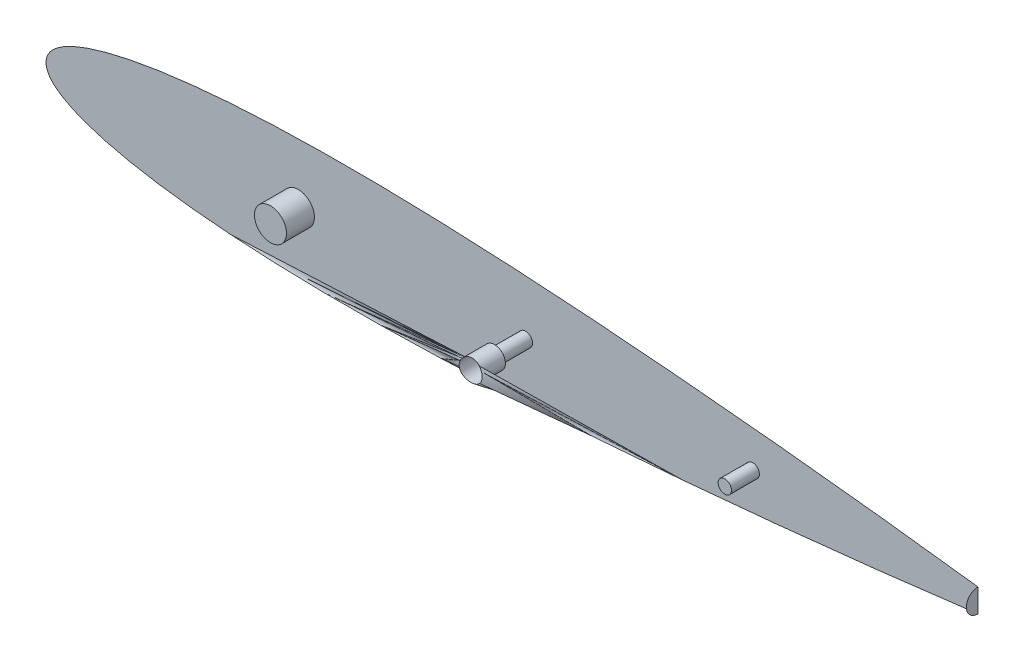
ISO-10303-21;
HEADER;
FILE_DESCRIPTION(('STEP AP214'),'2;1');
FILE_NAME('part.step','',(''),(''),'','','');
FILE_SCHEMA(('AUTOMOTIVE_DESIGN { 1 0 10303 214 1 1 1 1 }'));
ENDSEC;
DATA;
#1=APPLICATION_CONTEXT('core data for automotive mechanical design processes');
#2=APPLICATION_PROTOCOL_DEFINITION('international standard','automotive_design',2000,#1);
#3=PRODUCT_CONTEXT('',#1,'mechanical');
#4=PRODUCT('Part','Part','',(#3));
#5=PRODUCT_RELATED_PRODUCT_CATEGORY('part','',(#4));
#6=PRODUCT_DEFINITION_FORMATION('','',#4);
#7=PRODUCT_DEFINITION_CONTEXT('part definition',#1,'design');
#8=PRODUCT_DEFINITION('design','',#6,#7);
#9=PRODUCT_DEFINITION_SHAPE('','',#8);
#10=(LENGTH_UNIT() NAMED_UNIT(*) SI_UNIT(.MILLI.,.METRE.));
#11=(NAMED_UNIT(*) PLANE_ANGLE_UNIT() SI_UNIT($,.RADIAN.));
#12=(NAMED_UNIT(*) SI_UNIT($,.STERADIAN.) SOLID_ANGLE_UNIT());
#13=UNCERTAINTY_MEASURE_WITH_UNIT(LENGTH_MEASURE(1.E-05),#10,'distance_accuracy_value','');
#14=(GEOMETRIC_REPRESENTATION_CONTEXT(3) GLOBAL_UNCERTAINTY_ASSIGNED_CONTEXT((#13)) GLOBAL_UNIT_ASSIGNED_CONTEXT((#10,
#11,#12)) REPRESENTATION_CONTEXT('',''));
#15=CARTESIAN_POINT('',(0.,0.,0.));
#16=DIRECTION('',(0.,0.,1.));
#17=DIRECTION('',(1.,0.,0.));
#18=AXIS2_PLACEMENT_3D('',#15,#16,#17);
#19=CARTESIAN_POINT('',(154.375,0.,9.));
#20=DIRECTION('',(0.,0.,-1.));
#21=DIRECTION('',(-1.,0.,0.));
#22=AXIS2_PLACEMENT_3D('',#19,#20,#21);
#23=CYLINDRICAL_SURFACE('',#22,2.25000000000001);
#24=CARTESIAN_POINT('',(154.375,0.,0.));
#25=DIRECTION('',(0.,0.,1.));
#26=DIRECTION('',(1.,0.,0.));
#27=AXIS2_PLACEMENT_3D('',#24,#25,#26);
#28=CIRCLE('',#27,2.25000000000001);
#29=CARTESIAN_POINT('',(156.625,0.,0.));
#30=VERTEX_POINT('',#29);
#31=EDGE_CURVE('E72',#30,#30,#28,.T.);
#32=ORIENTED_EDGE('',*,*,#31,.F.);
#33=EDGE_LOOP('',(#32));
#34=FACE_BOUND('',#33,.T.);
#35=CARTESIAN_POINT('',(154.375,0.,10.));
#36=DIRECTION('',(0.,0.,1.));
#37=DIRECTION('',(1.,0.,0.));
#38=AXIS2_PLACEMENT_3D('',#35,#36,#37);
#39=CIRCLE('',#38,2.25000000000001);
#40=CARTESIAN_POINT('',(156.625,0.,10.));
#41=VERTEX_POINT('',#40);
#42=EDGE_CURVE('E93',#41,#41,#39,.T.);
#43=ORIENTED_EDGE('',*,*,#42,.T.);
#44=EDGE_LOOP('',(#43));
#45=FACE_BOUND('',#44,.T.);
#46=ADVANCED_FACE('F40',(#34,#45),#23,.F.);
#47=CARTESIAN_POINT('',(325.,-0.409500092908203,0.));
#48=CARTESIAN_POINT('',(324.209606779707,-0.519399758019909,0.));
#49=CARTESIAN_POINT('',(322.004222005564,-0.826045920838513,0.));
#50=CARTESIAN_POINT('',(318.131286115593,-1.36247994027025,0.));
#51=CARTESIAN_POINT('',(313.205110101778,-2.03042977351965,0.));
#52=CARTESIAN_POINT('',(307.754214134533,-2.75656118579781,0.));
#53=CARTESIAN_POINT('',(301.981376014149,-3.50796663809339,0.));
#54=CARTESIAN_POINT('',(296.03805070342,-4.26285960583456,0.));
#55=CARTESIAN_POINT('',(290.014777157156,-5.01477274249634,0.));
#56=CARTESIAN_POINT('',(283.957433959713,-5.75582617174039,0.));
#57=CARTESIAN_POINT('',(277.884033962146,-6.48070926718088,0.));
#58=CARTESIAN_POINT('',(271.799371840248,-7.19115834135747,0.));
#59=CARTESIAN_POINT('',(265.708673260098,-7.88859596103472,0.));
#60=CARTESIAN_POINT('',(259.617942627013,-8.57158743855156,0.));
#61=CARTESIAN_POINT('',(253.527208066558,-9.23757681250411,0.));
#62=CARTESIAN_POINT('',(247.432327629463,-9.8867511539944,0.));
#63=CARTESIAN_POINT('',(241.332260132785,-10.5225031273079,0.));
#64=CARTESIAN_POINT('',(235.230560492259,-11.1447506557175,0.));
#65=CARTESIAN_POINT('',(229.13083924923,-11.750855507004,0.));
#66=CARTESIAN_POINT('',(223.034064985933,-12.3409491955502,0.));
#67=CARTESIAN_POINT('',(216.939113887927,-12.9142946059218,0.));
#68=CARTESIAN_POINT('',(210.845263014783,-13.4708382241548,0.));
#69=CARTESIAN_POINT('',(204.753002950034,-14.0095743054351,0.));
#70=CARTESIAN_POINT('',(198.663296519111,-14.5308590099308,-1.01468446141068E-13));
#71=CARTESIAN_POINT('',(192.576797706318,-15.0327448367076,-1.0497309613791E-13));
#72=CARTESIAN_POINT('',(186.493961902939,-15.5146771463192,-1.08338411469099E-13));
#73=CARTESIAN_POINT('',(180.415624113057,-15.9768096197763,-1.11565465283397E-13));
#74=CARTESIAN_POINT('',(174.342680028814,-16.4170842140843,-1.14639886343383E-13));
#75=CARTESIAN_POINT('',(168.275982363255,-16.8340297465215,-1.1755140143502E-13));
#76=CARTESIAN_POINT('',(162.215629607513,-17.227874269312,-1.20301603038478E-13));
#77=CARTESIAN_POINT('',(156.161040662733,-17.5953372871673,-1.22867583577591E-13));
#78=CARTESIAN_POINT('',(150.112779892537,-17.9372096615737,-1.25254865608602E-13));
#79=CARTESIAN_POINT('',(144.07339040427,-18.2513514924148,-1.27448506288866E-13));
#80=CARTESIAN_POINT('',(138.046350310495,-18.5360668572273,-1.29436663055115E-13));
#81=CARTESIAN_POINT('',(132.034044160048,-18.7892202902279,-1.31204424029487E-13));
#82=CARTESIAN_POINT('',(126.035776650701,-19.0073658596331,-1.32727726398946E-13));
#83=CARTESIAN_POINT('',(120.050052914781,-19.1887400668134,-1.33994255718381E-13));
#84=CARTESIAN_POINT('',(114.076331660156,-19.3315438187763,-1.34991448988572E-13));
#85=CARTESIAN_POINT('',(108.117235085,-19.4351038734087,-1.35714604984969E-13));
#86=CARTESIAN_POINT('',(102.177171609536,-19.4963107317862,-1.36142010192637E-13));
#87=CARTESIAN_POINT('',(96.2603591758065,-19.5109725894527,-1.36244393397508E-13));
#88=CARTESIAN_POINT('',(90.3701487394855,-19.477507746103,-1.36010709645382E-13));
#89=CARTESIAN_POINT('',(84.5091329996222,-19.3907618384882,-1.35404966210067E-13));
#90=CARTESIAN_POINT('',(78.6807707597628,-19.2476243031086,-1.34405442142734E-13));
#91=CARTESIAN_POINT('',(72.8895764419093,-19.044369415657,-1.32986120849603E-13));
#92=CARTESIAN_POINT('',(67.1420867990852,-18.775812705953,-1.31110799368897E-13));
#93=CARTESIAN_POINT('',(61.4473554716223,-18.4394562222579,-1.28762034596857E-13));
#94=CARTESIAN_POINT('',(55.8188788592682,-18.0277086658247,-1.25886816777655E-13));
#95=CARTESIAN_POINT('',(50.2754905068753,-17.5393749526525,-1.22476800684318E-13));
#96=CARTESIAN_POINT('',(44.8436271748397,-16.9668120403667,-1.18478615237199E-13));
#97=CARTESIAN_POINT('',(39.5585789155564,-16.3084644660455,-1.13881398696768E-13));
#98=CARTESIAN_POINT('',(34.4705276450858,-15.5627624362783,-1.08674189254229E-13));
#99=CARTESIAN_POINT('',(29.646611553862,-14.7371020010913,-1.02908633250876E-13));
#100=CARTESIAN_POINT('',(25.1714180911802,-13.8478018726691,0.));
#101=CARTESIAN_POINT('',(21.1277937118721,-12.9136079103956,0.));
#102=CARTESIAN_POINT('',(17.5697242584204,-11.9649836605867,0.));
#103=CARTESIAN_POINT('',(14.5048810711105,-11.0230017775749,0.));
#104=CARTESIAN_POINT('',(11.9002690745365,-10.1112925690712,0.));
#105=CARTESIAN_POINT('',(9.70828673327457,-9.2322368829354,0.));
#106=CARTESIAN_POINT('',(7.87282777342717,-8.39255923931836,0.));
#107=CARTESIAN_POINT('',(6.33315120465822,-7.5948461466812,0.));
#108=CARTESIAN_POINT('',(5.03494774774097,-6.82568841761021,0.));
#109=CARTESIAN_POINT('',(3.93051534393519,-6.07372451829876,0.));
#110=CARTESIAN_POINT('',(2.98116190312331,-5.33718940014694,0.));
#111=CARTESIAN_POINT('',(2.17337222995282,-4.60407807518289,0.));
#112=CARTESIAN_POINT('',(1.50639491985576,-3.86778199382704,0.));
#113=CARTESIAN_POINT('',(0.976010289153782,-3.13185481717536,0.));
#114=CARTESIAN_POINT('',(0.573308222912746,-2.40523809186782,0.));
#115=CARTESIAN_POINT('',(0.282112492357996,-1.69699756555224,0.));
#116=CARTESIAN_POINT('',(0.0927816593963831,-1.00862248427365,0.));
#117=CARTESIAN_POINT('',(-0.00387542199190118,-0.334729508305403,0.));
#118=CARTESIAN_POINT('',(-0.00387542199177388,0.334729508359257,0.));
#119=CARTESIAN_POINT('',(0.0927816593965874,1.00862248432744,0.));
#120=CARTESIAN_POINT('',(0.282112492358435,1.69699756560601,0.));
#121=CARTESIAN_POINT('',(0.573308222913079,2.40523809192159,0.));
#122=CARTESIAN_POINT('',(0.97601028915413,3.13185481722909,0.));
#123=CARTESIAN_POINT('',(1.50639491985655,3.86778199388024,0.));
#124=CARTESIAN_POINT('',(2.17337222995325,4.60407807523815,0.));
#125=CARTESIAN_POINT('',(2.98116190312546,5.33718940019252,0.));
#126=CARTESIAN_POINT('',(3.9305153439307,6.07372451838545,0.));
#127=CARTESIAN_POINT('',(5.03494774776661,6.82568841751622,0.));
#128=CARTESIAN_POINT('',(6.33315120454879,7.5948461473982,0.));
#129=CARTESIAN_POINT('',(7.87282777394358,8.39255923628471,0.));
#130=CARTESIAN_POINT('',(9.70828673083819,9.232236897595,0.));
#131=CARTESIAN_POINT('',(11.9002690861299,10.1112924996648,0.));
#132=CARTESIAN_POINT('',(14.504881016298,11.0230021060787,0.));
#133=CARTESIAN_POINT('',(17.5697245150944,11.9649821226298,0.));
#134=CARTESIAN_POINT('',(21.1277925315336,12.9136149831782,0.));
#135=CARTESIAN_POINT('',(25.171423339769,13.8477704226069,0.));
#136=CARTESIAN_POINT('',(29.6465711781045,14.7372325178896,1.02909544644808E-13));
#137=CARTESIAN_POINT('',(34.470598676464,15.5622096745927,1.08670329340009E-13));
#138=CARTESIAN_POINT('',(39.5585394288991,16.3086186388837,1.13882475279943E-13));
#139=CARTESIAN_POINT('',(44.8436338253307,16.9667684771661,1.18478311036994E-13));
#140=CARTESIAN_POINT('',(50.275488670565,17.5393869812532,1.22476884679588E-13));
#141=CARTESIAN_POINT('',(55.8188793624637,18.0277053697656,1.25886793761397E-13));
#142=CARTESIAN_POINT('',(61.447355334478,18.4394571206696,1.28762040870432E-13));
#143=CARTESIAN_POINT('',(67.1420868363349,18.7758124620168,1.311107976655E-13));
#144=CARTESIAN_POINT('',(72.8895764318212,19.0443694817997,1.32986121311474E-13));
#145=CARTESIAN_POINT('',(78.6807707624955,19.2476242852699,1.34405442018168E-13));
#146=CARTESIAN_POINT('',(84.509132998888,19.3907618433586,1.35404966244076E-13));
#147=CARTESIAN_POINT('',(90.3701487396875,19.4775077448378,1.36010709636547E-13));
#148=CARTESIAN_POINT('',(96.2603591757561,19.5109725898425,1.3624439340023E-13));
#149=CARTESIAN_POINT('',(102.177171609554,19.4963107317282,1.36142010192232E-13));
#150=CARTESIAN_POINT('',(108.117235084999,19.4351038734702,1.35714604985398E-13));
#151=CARTESIAN_POINT('',(114.07633166016,19.3315438188044,1.34991448988768E-13));
#152=CARTESIAN_POINT('',(120.050052914783,19.1887400668492,1.33994255718631E-13));
#153=CARTESIAN_POINT('',(126.035776650704,19.0073658596656,1.32727726399173E-13));
#154=CARTESIAN_POINT('',(132.034044160051,18.78922029026,1.31204424029711E-13));
#155=CARTESIAN_POINT('',(138.046350310499,18.5360668572582,1.29436663055332E-13));
#156=CARTESIAN_POINT('',(144.073390404273,18.2513514924448,1.27448506289075E-13));
#157=CARTESIAN_POINT('',(150.11277989254,17.9372096616026,1.25254865608804E-13));
#158=CARTESIAN_POINT('',(156.161040662735,17.5953372871953,1.22867583577786E-13));
#159=CARTESIAN_POINT('',(162.215629607516,17.227874269339,1.20301603038666E-13));
#160=CARTESIAN_POINT('',(168.275982363258,16.8340297465474,1.17551401435201E-13));
#161=CARTESIAN_POINT('',(174.342680028817,16.4170842141092,1.14639886343557E-13));
#162=CARTESIAN_POINT('',(180.415624113059,15.9768096198003,1.11565465283564E-13));
#163=CARTESIAN_POINT('',(186.493961902942,15.5146771463421,1.08338411469259E-13));
#164=CARTESIAN_POINT('',(192.57679770632,15.0327448367295,1.04973096138063E-13));
#165=CARTESIAN_POINT('',(198.663296519113,14.5308590099518,1.01468446141214E-13));
#166=CARTESIAN_POINT('',(204.753002950037,14.009574305455,0.));
#167=CARTESIAN_POINT('',(210.845263014785,13.4708382241737,0.));
#168=CARTESIAN_POINT('',(216.93911388793,12.9142946059397,0.));
#169=CARTESIAN_POINT('',(223.034064985936,12.3409491955671,0.));
#170=CARTESIAN_POINT('',(229.130839249232,11.7508555070199,0.));
#171=CARTESIAN_POINT('',(235.230560492261,11.1447506557324,0.));
#172=CARTESIAN_POINT('',(241.332260132787,10.5225031273218,0.));
#173=CARTESIAN_POINT('',(247.432327629465,9.88675115400726,0.));
#174=CARTESIAN_POINT('',(253.527208066559,9.23757681251597,0.));
#175=CARTESIAN_POINT('',(259.617942627015,8.57158743856242,0.));
#176=CARTESIAN_POINT('',(265.7086732601,7.88859596104454,0.));
#177=CARTESIAN_POINT('',(271.79937184025,7.19115834136631,0.));
#178=CARTESIAN_POINT('',(277.884033962147,6.48070926718871,0.));
#179=CARTESIAN_POINT('',(283.957433959714,5.75582617174721,0.));
#180=CARTESIAN_POINT('',(290.014777157156,5.01477274250216,0.));
#181=CARTESIAN_POINT('',(296.03805070342,4.26285960583938,0.));
#182=CARTESIAN_POINT('',(301.98137601415,3.50796663809723,0.));
#183=CARTESIAN_POINT('',(307.754214134533,2.7565611858007,0.));
#184=CARTESIAN_POINT('',(313.205110101778,2.03042977352163,0.));
#185=CARTESIAN_POINT('',(318.131286115594,1.36247994027142,0.));
#186=CARTESIAN_POINT('',(322.004222005564,0.826045920839042,0.));
#187=CARTESIAN_POINT('',(324.209606779707,0.519399758020068,0.));
#188=CARTESIAN_POINT('',(325.,0.409500092908228,0.));
#189=B_SPLINE_CURVE_WITH_KNOTS('',3,(#47,#48,#49,#50,#51,#52,#53,#54,#55,#56,#57,#58,#59,#60,
#61,#62,#63,#64,#65,#66,#67,#68,#69,#70,#71,#72,#73,#74,#75,#76,#77,#78,#79,#80,#81,#82,#83,#84,
#85,#86,#87,#88,#89,#90,#91,#92,#93,#94,#95,#96,#97,#98,#99,#100,#101,#102,#103,#104,#105,#106,
#107,#108,#109,#110,#111,#112,#113,#114,#115,#116,#117,#118,#119,#120,#121,#122,#123,#124,#125,
#126,#127,#128,#129,#130,#131,#132,#133,#134,#135,#136,#137,#138,#139,#140,#141,#142,#143,#144,
#145,#146,#147,#148,#149,#150,#151,#152,#153,#154,#155,#156,#157,#158,#159,#160,#161,#162,#163,
#164,#165,#166,#167,#168,#169,#170,#171,#172,#173,#174,#175,#176,#177,#178,#179,#180,#181,#182,
#183,#184,#185,#186,#187,#188),.UNSPECIFIED.,.F.,.F.,(4,1,1,1,1,1,1,1,1,1,1,1,1,1,1,1,1,1,1,1,1,
1,1,1,1,1,1,1,1,1,1,1,1,1,1,1,1,1,1,1,1,1,1,1,1,1,1,1,1,1,1,1,1,1,1,1,1,1,1,1,1,1,1,1,1,1,1,1,1,
1,1,1,1,1,1,1,1,1,1,1,1,1,1,1,1,1,1,1,1,1,1,1,1,1,1,1,1,1,1,1,1,1,1,1,1,1,1,1,1,1,1,1,1,1,1,1,1,
1,1,1,1,1,1,1,1,1,1,1,1,1,1,1,1,1,1,1,1,1,1,4),(0.,0.00361222059404388,0.0100789532278554,
0.0176986181570895,0.0261151107220122,0.0349709660638799,0.0440503796486832,0.0532343297369713,
0.0624475697827881,0.0716739929600303,0.0809213185094618,0.0901775382979332,0.0994243421366575,
0.108664440992277,0.117912199004999,0.127169502180609,0.136426594565023,0.145675425736823,
0.154916495397513,0.164153236916375,0.173386648526191,0.182615736180586,0.191838089492061,
0.201053134496137,0.210260392550908,0.219458942389608,0.228646746886173,0.237822316287067,
0.24698522413025,0.25613738364592,0.265279415916296,0.274406949966901,0.283512193452554,
0.292591781113348,0.30164628535433,0.310681792653752,0.31969906757785,0.32869451957993,
0.337660159695399,0.346588583205171,0.355477411634764,0.364322937295264,0.373121613643215,
0.381867635356829,0.390553004884712,0.399166025869356,0.407689628257838,0.416098119030288,
0.424354887451602,0.432412428746428,0.440204728485537,0.447630505181733,0.454563637698397,
0.460855379429517,0.466413319364109,0.471228610451128,0.475365774282038,0.478901259753558,
0.481915077255184,0.484498871900912,0.486747127386087,0.488741251833575,0.490543179252672,
0.492182103901344,0.493672830547239,0.495031907807012,0.496279059618418,0.497424736506128,
0.498490165528455,0.499502757789975,0.500497253863142,0.501509846124661,0.502575275146988,
0.503720952034698,0.504968103846104,0.506327181105877,0.507817907751772,0.509456832400444,
0.511258759819541,0.51325288426703,0.515501139752205,0.518084934397933,0.521098751899559,
0.524634237371078,0.528771401201989,0.533586692289008,0.539144632223599,0.545436373954719,
0.552369506471383,0.559795200118754,0.567587571253572,0.575645112548398,0.583901880969712,
0.592310371742162,0.600833974130644,0.609446995115288,0.618132364643171,0.626878386356785,
0.635677062704736,0.644522588365236,0.653411416794829,0.662339840304601,0.67130548042007,
0.68030093242215,0.689318207346248,0.69835371464567,0.707408218886652,0.716487806547446,
0.725593050033099,0.734720584083704,0.74386261635408,0.75301477586975,0.762177683712933,
0.771353253113827,0.780541057610392,0.789739607449093,0.798946865503863,0.808161910507939,
0.817384263819414,0.826613351473809,0.835846763083625,0.845083504602487,0.854324574263177,
0.863573405434977,0.872830497819391,0.882087800995001,0.891335559007723,0.900575657863343,
0.909822461702067,0.919078681490538,0.92832600703997,0.937552430217212,0.946765670263029,
0.955949620351317,0.96502903393612,0.973884889277988,0.982301381842911,0.989921046772145,
0.996387779405956,1.),.UNSPECIFIED.);
#190=CARTESIAN_POINT('',(325.,0.,0.));
#191=DIRECTION('',(-1.,0.,0.));
#192=AXIS1_PLACEMENT('',#190,#191);
#193=SURFACE_OF_REVOLUTION('',#189,#192);
#194=CARTESIAN_POINT('',(157.875,0.,17.4896673409232));
#195=CARTESIAN_POINT('',(157.874992840233,-0.195725203351796,17.4896640474223));
#196=CARTESIAN_POINT('',(157.85852918341,-0.391543950731515,17.487332883651));
#197=CARTESIAN_POINT('',(157.793130106377,-0.777686191535585,17.4783365514055));
#198=CARTESIAN_POINT('',(157.744168307778,-0.968005089729,17.4716678622973));
#199=CARTESIAN_POINT('',(157.615253623173,-1.33754078242651,17.4549812834603));
#200=CARTESIAN_POINT('',(157.535321855179,-1.5167650458399,17.4449656765889));
#201=CARTESIAN_POINT('',(157.346761714884,-1.85926088543185,17.4230769460964));
#202=CARTESIAN_POINT('',(157.2381361202,-2.02253400361659,17.4112040023144));
#203=CARTESIAN_POINT('',(156.994408129167,-2.3296734920557,17.3873591570507));
#204=CARTESIAN_POINT('',(156.859140563797,-2.47340882851715,17.3753871089086));
#205=CARTESIAN_POINT('',(156.566306618615,-2.73621626782504,17.3534335375375));
#206=CARTESIAN_POINT('',(156.408739834237,-2.85528792311234,17.3434520504304));
#207=CARTESIAN_POINT('',(156.075659800772,-3.06537583746175,17.3274011521568));
#208=CARTESIAN_POINT('',(155.900143149061,-3.15638676408007,17.3213324843134));
#209=CARTESIAN_POINT('',(155.536221001339,-3.30762496652271,17.3146934448072));
#210=CARTESIAN_POINT('',(155.347816905953,-3.36785558158216,17.3141224766005));
#211=CARTESIAN_POINT('',(154.966216577619,-3.45517937968727,17.3194423499115));
#212=CARTESIAN_POINT('',(154.773117695811,-3.48270356513422,17.3252471604881));
#213=CARTESIAN_POINT('',(154.385346099892,-3.50536893933976,17.3434268997188));
#214=CARTESIAN_POINT('',(154.190673444545,-3.50051133168956,17.355801584163));
#215=CARTESIAN_POINT('',(153.806283961096,-3.45886563381944,17.3865258658424));
#216=CARTESIAN_POINT('',(153.616546981603,-3.42223987139235,17.404844792017));
#217=CARTESIAN_POINT('',(153.246141223691,-3.31853561751791,17.4462900209805));
#218=CARTESIAN_POINT('',(153.065473390163,-3.25145396023314,17.4694168234044));
#219=CARTESIAN_POINT('',(152.714978171396,-3.0874570279365,17.5191897077994));
#220=CARTESIAN_POINT('',(152.545384390232,-2.99005867779293,17.5458884662335));
#221=CARTESIAN_POINT('',(152.224836731585,-2.76853143466891,17.6003536739227));
#222=CARTESIAN_POINT('',(152.073885326646,-2.64439900191549,17.6281202641655));
#223=CARTESIAN_POINT('',(151.792003700729,-2.37012716088081,17.6829210152147));
#224=CARTESIAN_POINT('',(151.66149380502,-2.21955055557585,17.7099322417584));
#225=CARTESIAN_POINT('',(151.427639500113,-1.89804440550056,17.7602776587761));
#226=CARTESIAN_POINT('',(151.324294068696,-1.72711562694963,17.7836119876013));
#227=CARTESIAN_POINT('',(151.148599505024,-1.37093815266151,17.8243032409126));
#228=CARTESIAN_POINT('',(151.07602432481,-1.18580612075037,17.8417035665868));
#229=CARTESIAN_POINT('',(150.963165942071,-0.805432873660454,17.8691207748001));
#230=CARTESIAN_POINT('',(150.922876520867,-0.610193612989233,17.879139079188));
#231=CARTESIAN_POINT('',(150.876617668372,-0.220767866084021,17.8906667040212));
#232=CARTESIAN_POINT('',(150.869757202002,-0.0266934517516908,17.8923969184782));
#233=CARTESIAN_POINT('',(150.888173735816,0.359815397359883,17.8877880451935));
#234=CARTESIAN_POINT('',(150.913448173452,0.552249961674566,17.8814496008742));
#235=CARTESIAN_POINT('',(150.994769133372,0.92761991296615,17.8614178288331));
#236=CARTESIAN_POINT('',(151.050437845472,1.11064233773737,17.8478148460784));
#237=CARTESIAN_POINT('',(151.190532171721,1.46472728324791,17.8145186756947));
#238=CARTESIAN_POINT('',(151.274960408803,1.63578871140142,17.7948249325895));
#239=CARTESIAN_POINT('',(151.471824588993,1.96440861315793,17.7506465053847));
#240=CARTESIAN_POINT('',(151.584725626285,2.12167776283206,17.726083877522));
#241=CARTESIAN_POINT('',(151.834615762242,2.41529025249052,17.6744871990341));
#242=CARTESIAN_POINT('',(151.971608730377,2.55163022438515,17.6474527517387));
#243=CARTESIAN_POINT('',(152.269878065725,2.803118371016,17.5924458154079));
#244=CARTESIAN_POINT('',(152.431685354819,2.91763623825486,17.5644670052624));
#245=CARTESIAN_POINT('',(152.772555193912,3.11789107208112,17.5106076504932));
#246=CARTESIAN_POINT('',(152.951618191485,3.20362729187955,17.4847271603271));
#247=CARTESIAN_POINT('',(153.322665701988,3.34395470490174,17.4370968585908));
#248=CARTESIAN_POINT('',(153.514684032548,3.39846056022644,17.4153584724699));
#249=CARTESIAN_POINT('',(153.905737032118,3.47410954556616,17.3777397961782));
#250=CARTESIAN_POINT('',(154.104770676564,3.49525752691826,17.3618586544281));
#251=CARTESIAN_POINT('',(154.499864590175,3.50323414347341,17.3371495003291));
#252=CARTESIAN_POINT('',(154.695902322343,3.49075645189518,17.3281837615737));
#253=CARTESIAN_POINT('',(155.083312705906,3.43316703314234,17.3168871172644));
#254=CARTESIAN_POINT('',(155.274685701238,3.3880577195153,17.3145557210745));
#255=CARTESIAN_POINT('',(155.644683853794,3.26730419971484,17.3158584420439));
#256=CARTESIAN_POINT('',(155.823444593,3.1920736217884,17.31941371682));
#257=CARTESIAN_POINT('',(156.165995964551,3.0132486804241,17.3310804016768));
#258=CARTESIAN_POINT('',(156.329786105019,2.90965338547625,17.3391919613972));
#259=CARTESIAN_POINT('',(156.639283341001,2.6759939205505,17.3583687090941));
#260=CARTESIAN_POINT('',(156.784822344117,2.54570923188641,17.3694587608423));
#261=CARTESIAN_POINT('',(157.052241475011,2.26280214918139,17.3926266556839));
#262=CARTESIAN_POINT('',(157.174116112349,2.11017458567684,17.4047047270889));
#263=CARTESIAN_POINT('',(157.392183599729,1.78477900588212,17.4280768155406));
#264=CARTESIAN_POINT('',(157.488044712819,1.61178783315402,17.4393594589079));
#265=CARTESIAN_POINT('',(157.649291897637,1.25211354580512,17.4592296043371));
#266=CARTESIAN_POINT('',(157.714703673724,1.06544213426617,17.4678193776264));
#267=CARTESIAN_POINT('',(157.80077436921,0.731988785290655,17.4793682113643));
#268=CARTESIAN_POINT('',(157.828562612928,0.587034543571325,17.4832013350877));
#269=CARTESIAN_POINT('',(157.865677981131,0.294737860078465,17.4883521204917));
#270=CARTESIAN_POINT('',(157.87500539183,0.147395455366511,17.4896698211713));
#271=CARTESIAN_POINT('',(157.875,0.,17.4896673409232));
#272=B_SPLINE_CURVE_WITH_KNOTS('',3,(#194,#195,#196,#197,#198,#199,#200,#201,#202,#203,#204,
#205,#206,#207,#208,#209,#210,#211,#212,#213,#214,#215,#216,#217,#218,#219,#220,#221,#222,#223,
#224,#225,#226,#227,#228,#229,#230,#231,#232,#233,#234,#235,#236,#237,#238,#239,#240,#241,#242,
#243,#244,#245,#246,#247,#248,#249,#250,#251,#252,#253,#254,#255,#256,#257,#258,#259,#260,#261,
#262,#263,#264,#265,#266,#267,#268,#269,#270,#271),.UNSPECIFIED.,.T.,.F.,(4,2,2,2,2,2,2,2,2,2,2,
2,2,2,2,2,2,2,2,2,2,2,2,2,2,2,2,2,2,2,2,2,2,2,2,2,2,2,4),(0.,0.586639730164962,1.17375621269367,
1.76047305087812,2.34713311457597,2.93755170340677,3.52798100532146,4.11852243879715,
4.70899979314434,5.29160640749643,5.87419136720187,6.45381687575929,7.03350264918211,
7.62294403282691,8.21246351052396,8.81284925970325,9.41321241267924,10.0090853006237,
10.604843387663,11.1846315118709,11.7643734046801,12.3370677710447,12.9098143824293,
13.492602704698,14.075484715798,14.6732563401422,15.2710434734931,15.8704563820237,
16.4697821080716,17.0568393203181,17.6438531162224,18.2230682340396,18.8023023758226,
19.3865307965078,19.9708946042027,20.5623933463214,21.1533918544927,21.5951815131923,
22.0369643223705),.UNSPECIFIED.);
#273=CARTESIAN_POINT('',(157.875,0.,17.4896673409232));
#274=VERTEX_POINT('',#273);
#275=EDGE_CURVE('E46',#274,#274,#272,.T.);
#276=ORIENTED_EDGE('',*,*,#275,.T.);
#277=EDGE_LOOP('',(#276));
#278=FACE_BOUND('',#277,.T.);
#279=CARTESIAN_POINT('',(300.,0.,0.));
#280=DIRECTION('',(-1.,0.,0.));
#281=DIRECTION('',(0.,-1.,0.));
#282=AXIS2_PLACEMENT_3D('',#279,#280,#281);
#283=CIRCLE('',#282,3.75863618859276);
#284=CARTESIAN_POINT('',(300.,3.75863618925211,0.));
#285=VERTEX_POINT('',#284);
#286=CARTESIAN_POINT('',(299.999999994832,-3.7586361892521,0.));
#287=VERTEX_POINT('',#286);
#288=EDGE_CURVE('E61',#285,#287,#283,.F.);
#289=ORIENTED_EDGE('',*,*,#288,.F.);
#290=CARTESIAN_POINT('',(325.,0.409500092908216,0.));
#291=CARTESIAN_POINT('',(324.209606779707,0.519399758019921,0.));
#292=CARTESIAN_POINT('',(322.004222005564,0.826045920838526,0.));
#293=CARTESIAN_POINT('',(318.131286115593,1.36247994027026,0.));
#294=CARTESIAN_POINT('',(313.205110101778,2.03042977351966,0.));
#295=CARTESIAN_POINT('',(307.754214134533,2.75656118579783,0.));
#296=CARTESIAN_POINT('',(301.981376014149,3.5079666380934,0.));
#297=CARTESIAN_POINT('',(296.03805070342,4.26285960583457,0.));
#298=CARTESIAN_POINT('',(290.014777157156,5.01477274249635,0.));
#299=CARTESIAN_POINT('',(283.957433959713,5.7558261717404,0.));
#300=CARTESIAN_POINT('',(277.884033962146,6.48070926718089,0.));
#301=CARTESIAN_POINT('',(271.799371840248,7.19115834135748,0.));
#302=CARTESIAN_POINT('',(265.708673260098,7.88859596103473,0.));
#303=CARTESIAN_POINT('',(259.617942627013,8.57158743855157,0.));
#304=CARTESIAN_POINT('',(253.527208066558,9.23757681250412,0.));
#305=CARTESIAN_POINT('',(247.432327629463,9.88675115399441,0.));
#306=CARTESIAN_POINT('',(241.332260132785,10.5225031273079,0.));
#307=CARTESIAN_POINT('',(235.230560492259,11.1447506557175,0.));
#308=CARTESIAN_POINT('',(229.13083924923,11.750855507004,0.));
#309=CARTESIAN_POINT('',(223.034064985933,12.3409491955502,0.));
#310=CARTESIAN_POINT('',(216.939113887927,12.9142946059218,0.));
#311=CARTESIAN_POINT('',(210.845263014783,13.4708382241548,0.));
#312=CARTESIAN_POINT('',(204.753002950034,14.0095743054351,0.));
#313=CARTESIAN_POINT('',(198.663296519111,14.5308590099308,0.));
#314=CARTESIAN_POINT('',(192.576797706318,15.0327448367076,0.));
#315=CARTESIAN_POINT('',(186.493961902939,15.5146771463192,0.));
#316=CARTESIAN_POINT('',(180.415624113057,15.9768096197763,0.));
#317=CARTESIAN_POINT('',(174.342680028814,16.4170842140843,0.));
#318=CARTESIAN_POINT('',(168.275982363255,16.8340297465215,0.));
#319=CARTESIAN_POINT('',(162.215629607513,17.227874269312,0.));
#320=CARTESIAN_POINT('',(156.161040662733,17.5953372871673,0.));
#321=CARTESIAN_POINT('',(150.112779892537,17.9372096615737,0.));
#322=CARTESIAN_POINT('',(144.07339040427,18.2513514924148,0.));
#323=CARTESIAN_POINT('',(138.046350310495,18.5360668572273,0.));
#324=CARTESIAN_POINT('',(132.034044160048,18.7892202902279,0.));
#325=CARTESIAN_POINT('',(126.035776650701,19.0073658596331,0.));
#326=CARTESIAN_POINT('',(120.050052914781,19.1887400668134,0.));
#327=CARTESIAN_POINT('',(114.076331660156,19.3315438187763,0.));
#328=CARTESIAN_POINT('',(108.117235085,19.4351038734087,0.));
#329=CARTESIAN_POINT('',(102.177171609536,19.4963107317862,0.));
#330=CARTESIAN_POINT('',(96.2603591758065,19.5109725894527,0.));
#331=CARTESIAN_POINT('',(90.3701487394855,19.477507746103,0.));
#332=CARTESIAN_POINT('',(84.5091329996222,19.3907618384882,0.));
#333=CARTESIAN_POINT('',(78.6807707597628,19.2476243031086,0.));
#334=CARTESIAN_POINT('',(72.8895764419093,19.044369415657,0.));
#335=CARTESIAN_POINT('',(67.1420867990852,18.775812705953,0.));
#336=CARTESIAN_POINT('',(61.4473554716223,18.4394562222579,0.));
#337=CARTESIAN_POINT('',(55.8188788592682,18.0277086658247,0.));
#338=CARTESIAN_POINT('',(50.2754905068753,17.5393749526525,0.));
#339=CARTESIAN_POINT('',(44.8436271748397,16.9668120403667,0.));
#340=CARTESIAN_POINT('',(39.5585789155564,16.3084644660455,0.));
#341=CARTESIAN_POINT('',(34.4705276450858,15.5627624362783,0.));
#342=CARTESIAN_POINT('',(29.646611553862,14.7371020010913,0.));
#343=CARTESIAN_POINT('',(25.1714180911802,13.8478018726691,0.));
#344=CARTESIAN_POINT('',(21.1277937118721,12.9136079103956,0.));
#345=CARTESIAN_POINT('',(17.5697242584204,11.9649836605867,0.));
#346=CARTESIAN_POINT('',(14.5048810711105,11.0230017775749,0.));
#347=CARTESIAN_POINT('',(11.9002690745365,10.1112925690712,0.));
#348=CARTESIAN_POINT('',(9.70828673327457,9.2322368829354,0.));
#349=CARTESIAN_POINT('',(7.87282777342717,8.39255923931836,0.));
#350=CARTESIAN_POINT('',(6.33315120465822,7.5948461466812,0.));
#351=CARTESIAN_POINT('',(5.03494774774097,6.82568841761021,0.));
#352=CARTESIAN_POINT('',(3.93051534393519,6.07372451829876,0.));
#353=CARTESIAN_POINT('',(2.98116190312331,5.33718940014694,0.));
#354=CARTESIAN_POINT('',(2.17337222995282,4.60407807518289,0.));
#355=CARTESIAN_POINT('',(1.50639491985576,3.86778199382704,0.));
#356=CARTESIAN_POINT('',(0.976010289153782,3.13185481717536,0.));
#357=CARTESIAN_POINT('',(0.573308222912746,2.40523809186782,0.));
#358=CARTESIAN_POINT('',(0.282112492357996,1.69699756555224,0.));
#359=CARTESIAN_POINT('',(0.0927816593963831,1.00862248427365,0.));
#360=CARTESIAN_POINT('',(-0.0038754219919012,0.334729508305403,0.));
#361=CARTESIAN_POINT('',(-0.00387542199177386,-0.334729508359257,0.));
#362=CARTESIAN_POINT('',(0.0927816593965874,-1.00862248432744,0.));
#363=CARTESIAN_POINT('',(0.282112492358435,-1.69699756560601,0.));
#364=CARTESIAN_POINT('',(0.573308222913079,-2.40523809192159,0.));
#365=CARTESIAN_POINT('',(0.97601028915413,-3.13185481722909,0.));
#366=CARTESIAN_POINT('',(1.50639491985655,-3.86778199388024,0.));
#367=CARTESIAN_POINT('',(2.17337222995325,-4.60407807523815,0.));
#368=CARTESIAN_POINT('',(2.98116190312546,-5.33718940019252,0.));
#369=CARTESIAN_POINT('',(3.9305153439307,-6.07372451838545,0.));
#370=CARTESIAN_POINT('',(5.03494774776661,-6.82568841751622,0.));
#371=CARTESIAN_POINT('',(6.33315120454879,-7.5948461473982,0.));
#372=CARTESIAN_POINT('',(7.87282777394358,-8.39255923628471,0.));
#373=CARTESIAN_POINT('',(9.70828673083819,-9.232236897595,0.));
#374=CARTESIAN_POINT('',(11.9002690861299,-10.1112924996648,0.));
#375=CARTESIAN_POINT('',(14.504881016298,-11.0230021060787,0.));
#376=CARTESIAN_POINT('',(17.5697245150944,-11.9649821226298,0.));
#377=CARTESIAN_POINT('',(21.1277925315336,-12.9136149831782,0.));
#378=CARTESIAN_POINT('',(25.171423339769,-13.8477704226069,0.));
#379=CARTESIAN_POINT('',(29.6465711781045,-14.7372325178896,0.));
#380=CARTESIAN_POINT('',(34.470598676464,-15.5622096745927,0.));
#381=CARTESIAN_POINT('',(39.5585394288991,-16.3086186388837,0.));
#382=CARTESIAN_POINT('',(44.8436338253307,-16.9667684771661,0.));
#383=CARTESIAN_POINT('',(50.275488670565,-17.5393869812532,0.));
#384=CARTESIAN_POINT('',(55.8188793624637,-18.0277053697656,0.));
#385=CARTESIAN_POINT('',(61.447355334478,-18.4394571206695,0.));
#386=CARTESIAN_POINT('',(67.1420868363349,-18.7758124620168,0.));
#387=CARTESIAN_POINT('',(72.8895764318212,-19.0443694817997,0.));
#388=CARTESIAN_POINT('',(78.6807707624955,-19.2476242852699,0.));
#389=CARTESIAN_POINT('',(84.509132998888,-19.3907618433586,0.));
#390=CARTESIAN_POINT('',(90.3701487396875,-19.4775077448378,0.));
#391=CARTESIAN_POINT('',(96.2603591757561,-19.5109725898425,0.));
#392=CARTESIAN_POINT('',(102.177171609554,-19.4963107317282,0.));
#393=CARTESIAN_POINT('',(108.117235084999,-19.4351038734702,0.));
#394=CARTESIAN_POINT('',(114.07633166016,-19.3315438188044,0.));
#395=CARTESIAN_POINT('',(120.050052914783,-19.1887400668492,0.));
#396=CARTESIAN_POINT('',(126.035776650704,-19.0073658596656,0.));
#397=CARTESIAN_POINT('',(132.034044160051,-18.78922029026,0.));
#398=CARTESIAN_POINT('',(138.046350310499,-18.5360668572582,0.));
#399=CARTESIAN_POINT('',(144.073390404273,-18.2513514924447,0.));
#400=CARTESIAN_POINT('',(150.11277989254,-17.9372096616026,0.));
#401=CARTESIAN_POINT('',(156.161040662735,-17.5953372871953,0.));
#402=CARTESIAN_POINT('',(162.215629607516,-17.227874269339,0.));
#403=CARTESIAN_POINT('',(168.275982363258,-16.8340297465474,0.));
#404=CARTESIAN_POINT('',(174.342680028817,-16.4170842141092,0.));
#405=CARTESIAN_POINT('',(180.415624113059,-15.9768096198002,0.));
#406=CARTESIAN_POINT('',(186.493961902942,-15.5146771463421,0.));
#407=CARTESIAN_POINT('',(192.57679770632,-15.0327448367295,0.));
#408=CARTESIAN_POINT('',(198.663296519113,-14.5308590099518,0.));
#409=CARTESIAN_POINT('',(204.753002950037,-14.009574305455,0.));
#410=CARTESIAN_POINT('',(210.845263014785,-13.4708382241737,0.));
#411=CARTESIAN_POINT('',(216.93911388793,-12.9142946059397,0.));
#412=CARTESIAN_POINT('',(223.034064985936,-12.340949195567,0.));
#413=CARTESIAN_POINT('',(229.130839249232,-11.7508555070199,0.));
#414=CARTESIAN_POINT('',(235.230560492261,-11.1447506557323,0.));
#415=CARTESIAN_POINT('',(241.332260132787,-10.5225031273218,0.));
#416=CARTESIAN_POINT('',(247.432327629465,-9.88675115400725,0.));
#417=CARTESIAN_POINT('',(253.527208066559,-9.23757681251596,0.));
#418=CARTESIAN_POINT('',(259.617942627015,-8.57158743856241,0.));
#419=CARTESIAN_POINT('',(265.7086732601,-7.88859596104453,0.));
#420=CARTESIAN_POINT('',(271.79937184025,-7.1911583413663,0.));
#421=CARTESIAN_POINT('',(277.884033962147,-6.4807092671887,0.));
#422=CARTESIAN_POINT('',(283.957433959714,-5.7558261717472,0.));
#423=CARTESIAN_POINT('',(290.014777157156,-5.01477274250215,0.));
#424=CARTESIAN_POINT('',(296.03805070342,-4.26285960583937,0.));
#425=CARTESIAN_POINT('',(301.98137601415,-3.50796663809722,0.));
#426=CARTESIAN_POINT('',(307.754214134533,-2.75656118580069,0.));
#427=CARTESIAN_POINT('',(313.205110101778,-2.03042977352162,0.));
#428=CARTESIAN_POINT('',(318.131286115594,-1.36247994027141,0.));
#429=CARTESIAN_POINT('',(322.004222005564,-0.82604592083903,0.));
#430=CARTESIAN_POINT('',(324.209606779707,-0.519399758020056,0.));
#431=CARTESIAN_POINT('',(325.,-0.409500092908216,0.));
#432=B_SPLINE_CURVE_WITH_KNOTS('',3,(#290,#291,#292,#293,#294,#295,#296,#297,#298,#299,#300,
#301,#302,#303,#304,#305,#306,#307,#308,#309,#310,#311,#312,#313,#314,#315,#316,#317,#318,#319,
#320,#321,#322,#323,#324,#325,#326,#327,#328,#329,#330,#331,#332,#333,#334,#335,#336,#337,#338,
#339,#340,#341,#342,#343,#344,#345,#346,#347,#348,#349,#350,#351,#352,#353,#354,#355,#356,#357,
#358,#359,#360,#361,#362,#363,#364,#365,#366,#367,#368,#369,#370,#371,#372,#373,#374,#375,#376,
#377,#378,#379,#380,#381,#382,#383,#384,#385,#386,#387,#388,#389,#390,#391,#392,#393,#394,#395,
#396,#397,#398,#399,#400,#401,#402,#403,#404,#405,#406,#407,#408,#409,#410,#411,#412,#413,#414,
#415,#416,#417,#418,#419,#420,#421,#422,#423,#424,#425,#426,#427,#428,#429,#430,#431),
.UNSPECIFIED.,.F.,.F.,(4,1,1,1,1,1,1,1,1,1,1,1,1,1,1,1,1,1,1,1,1,1,1,1,1,1,1,1,1,1,1,1,1,1,1,1,
1,1,1,1,1,1,1,1,1,1,1,1,1,1,1,1,1,1,1,1,1,1,1,1,1,1,1,1,1,1,1,1,1,1,1,1,1,1,1,1,1,1,1,1,1,1,1,1,
1,1,1,1,1,1,1,1,1,1,1,1,1,1,1,1,1,1,1,1,1,1,1,1,1,1,1,1,1,1,1,1,1,1,1,1,1,1,1,1,1,1,1,1,1,1,1,1,
1,1,1,1,1,1,1,4),(0.,0.00361222059404388,0.0100789532278554,0.0176986181570895,
0.0261151107220122,0.0349709660638799,0.0440503796486832,0.0532343297369713,0.0624475697827881,
0.0716739929600303,0.0809213185094618,0.0901775382979332,0.0994243421366575,0.108664440992277,
0.117912199004999,0.127169502180609,0.136426594565023,0.145675425736823,0.154916495397513,
0.164153236916375,0.173386648526191,0.182615736180586,0.191838089492061,0.201053134496137,
0.210260392550908,0.219458942389608,0.228646746886173,0.237822316287067,0.24698522413025,
0.25613738364592,0.265279415916296,0.274406949966901,0.283512193452554,0.292591781113348,
0.30164628535433,0.310681792653752,0.31969906757785,0.32869451957993,0.337660159695399,
0.346588583205171,0.355477411634764,0.364322937295264,0.373121613643215,0.381867635356829,
0.390553004884712,0.399166025869356,0.407689628257838,0.416098119030288,0.424354887451602,
0.432412428746428,0.440204728485537,0.447630505181733,0.454563637698397,0.460855379429517,
0.466413319364109,0.471228610451128,0.475365774282038,0.478901259753558,0.481915077255184,
0.484498871900912,0.486747127386087,0.488741251833575,0.490543179252672,0.492182103901344,
0.493672830547239,0.495031907807012,0.496279059618418,0.497424736506128,0.498490165528455,
0.499502757789975,0.500497253863142,0.501509846124661,0.502575275146988,0.503720952034698,
0.504968103846104,0.506327181105877,0.507817907751772,0.509456832400444,0.511258759819541,
0.51325288426703,0.515501139752205,0.518084934397933,0.521098751899559,0.524634237371078,
0.528771401201989,0.533586692289008,0.539144632223599,0.545436373954719,0.552369506471383,
0.559795200118754,0.567587571253572,0.575645112548398,0.583901880969712,0.592310371742162,
0.600833974130644,0.609446995115288,0.618132364643171,0.626878386356785,0.635677062704736,
0.644522588365236,0.653411416794829,0.662339840304601,0.67130548042007,0.68030093242215,
0.689318207346248,0.69835371464567,0.707408218886652,0.716487806547446,0.725593050033099,
0.734720584083704,0.74386261635408,0.75301477586975,0.762177683712933,0.771353253113827,
0.780541057610392,0.789739607449093,0.798946865503863,0.808161910507939,0.817384263819414,
0.826613351473809,0.835846763083625,0.845083504602487,0.854324574263177,0.863573405434977,
0.872830497819391,0.882087800995001,0.891335559007723,0.900575657863343,0.909822461702067,
0.919078681490538,0.92832600703997,0.937552430217212,0.946765670263029,0.955949620351317,
0.96502903393612,0.973884889277988,0.982301381842911,0.989921046772145,0.996387779405956,1.),.UNSPECIFIED.);
#433=CARTESIAN_POINT('',(0.,0.,0.));
#434=VERTEX_POINT('',#433);
#435=EDGE_CURVE('E67',#285,#434,#432,.T.);
#436=ORIENTED_EDGE('',*,*,#435,.T.);
#437=EDGE_CURVE('E54',#287,#434,#189,.T.);
#438=ORIENTED_EDGE('',*,*,#437,.F.);
#439=EDGE_LOOP('',(#289,#436,#438));
#440=FACE_BOUND('',#439,.T.);
#441=ADVANCED_FACE('F42',(#278,#440),#193,.T.);
#442=CARTESIAN_POINT('',(0.,0.,0.));
#443=DIRECTION('',(0.,0.,-1.));
#444=DIRECTION('',(1.,0.,0.));
#445=AXIS2_PLACEMENT_3D('',#442,#443,#444);
#446=PLANE('',#445);
#447=CARTESIAN_POINT('',(81.25,0.,0.));
#448=DIRECTION('',(0.,0.,1.));
#449=DIRECTION('',(1.,0.,0.));
#450=AXIS2_PLACEMENT_3D('',#447,#448,#449);
#451=CIRCLE('',#450,5.14999999999998);
#452=CARTESIAN_POINT('',(86.4,0.,0.));
#453=VERTEX_POINT('',#452);
#454=EDGE_CURVE('E78',#453,#453,#451,.T.);
#455=ORIENTED_EDGE('',*,*,#454,.T.);
#456=EDGE_LOOP('',(#455));
#457=FACE_BOUND('',#456,.T.);
#458=CARTESIAN_POINT('',(227.5,0.,0.));
#459=DIRECTION('',(0.,0.,1.));
#460=DIRECTION('',(1.,0.,0.));
#461=AXIS2_PLACEMENT_3D('',#458,#459,#460);
#462=CIRCLE('',#461,2.15000000000002);
#463=CARTESIAN_POINT('',(229.65,0.,0.));
#464=VERTEX_POINT('',#463);
#465=EDGE_CURVE('E108',#464,#464,#462,.T.);
#466=ORIENTED_EDGE('',*,*,#465,.T.);
#467=EDGE_LOOP('',(#466));
#468=FACE_BOUND('',#467,.T.);
#469=ORIENTED_EDGE('',*,*,#31,.T.);
#470=EDGE_LOOP('',(#469));
#471=FACE_BOUND('',#470,.T.);
#472=ORIENTED_EDGE('',*,*,#435,.F.);
#473=DIRECTION('',(0.,-1.,0.));
#474=VECTOR('',#473,1.);
#475=CARTESIAN_POINT('',(300.,0.,0.));
#476=LINE('',#475,#474);
#477=EDGE_CURVE('E11',#285,#287,#476,.T.);
#478=ORIENTED_EDGE('',*,*,#477,.T.);
#479=ORIENTED_EDGE('',*,*,#437,.T.);
#480=EDGE_LOOP('',(#472,#478,#479));
#481=FACE_BOUND('',#480,.T.);
#482=ADVANCED_FACE('F74',(#457,#468,#471,#481),#446,.T.);
#483=CARTESIAN_POINT('',(227.5,0.,9.));
#484=DIRECTION('',(0.,0.,-1.));
#485=DIRECTION('',(-1.,0.,0.));
#486=AXIS2_PLACEMENT_3D('',#483,#484,#485);
#487=CYLINDRICAL_SURFACE('',#486,2.15000000000002);
#488=CARTESIAN_POINT('',(227.5,0.,9.));
#489=DIRECTION('',(0.,0.,1.));
#490=DIRECTION('',(1.,0.,0.));
#491=AXIS2_PLACEMENT_3D('',#488,#489,#490);
#492=CIRCLE('',#491,2.15000000000002);
#493=CARTESIAN_POINT('',(229.65,0.,9.));
#494=VERTEX_POINT('',#493);
#495=EDGE_CURVE('E106',#494,#494,#492,.T.);
#496=ORIENTED_EDGE('',*,*,#495,.T.);
#497=EDGE_LOOP('',(#496));
#498=FACE_BOUND('',#497,.T.);
#499=ORIENTED_EDGE('',*,*,#465,.F.);
#500=EDGE_LOOP('',(#499));
#501=FACE_BOUND('',#500,.T.);
#502=ADVANCED_FACE('F123',(#498,#501),#487,.F.);
#503=CARTESIAN_POINT('',(227.5,0.,9.));
#504=DIRECTION('',(0.,0.,1.));
#505=DIRECTION('',(1.,0.,0.));
#506=AXIS2_PLACEMENT_3D('',#503,#504,#505);
#507=PLANE('',#506);
#508=ORIENTED_EDGE('',*,*,#495,.F.);
#509=EDGE_LOOP('',(#508));
#510=FACE_BOUND('',#509,.T.);
#511=ADVANCED_FACE('F130',(#510),#507,.F.);
#512=CARTESIAN_POINT('',(81.25,0.,9.));
#513=DIRECTION('',(0.,0.,-1.));
#514=DIRECTION('',(-1.,0.,0.));
#515=AXIS2_PLACEMENT_3D('',#512,#513,#514);
#516=CYLINDRICAL_SURFACE('',#515,5.14999999999998);
#517=CARTESIAN_POINT('',(81.25,0.,9.));
#518=DIRECTION('',(0.,0.,1.));
#519=DIRECTION('',(1.,0.,0.));
#520=AXIS2_PLACEMENT_3D('',#517,#518,#519);
#521=CIRCLE('',#520,5.14999999999998);
#522=CARTESIAN_POINT('',(86.4,0.,9.));
#523=VERTEX_POINT('',#522);
#524=EDGE_CURVE('E75',#523,#523,#521,.T.);
#525=ORIENTED_EDGE('',*,*,#524,.T.);
#526=EDGE_LOOP('',(#525));
#527=FACE_BOUND('',#526,.T.);
#528=ORIENTED_EDGE('',*,*,#454,.F.);
#529=EDGE_LOOP('',(#528));
#530=FACE_BOUND('',#529,.T.);
#531=ADVANCED_FACE('F134',(#527,#530),#516,.F.);
#532=CARTESIAN_POINT('',(81.25,0.,9.));
#533=DIRECTION('',(0.,0.,1.));
#534=DIRECTION('',(1.,0.,0.));
#535=AXIS2_PLACEMENT_3D('',#532,#533,#534);
#536=PLANE('',#535);
#537=ORIENTED_EDGE('',*,*,#524,.F.);
#538=EDGE_LOOP('',(#537));
#539=FACE_BOUND('',#538,.T.);
#540=ADVANCED_FACE('F136',(#539),#536,.F.);
#541=CARTESIAN_POINT('',(300.,100.,19.5109725894528));
#542=DIRECTION('',(1.,0.,0.));
#543=DIRECTION('',(0.,0.,-1.));
#544=AXIS2_PLACEMENT_3D('',#541,#542,#543);
#545=PLANE('',#544);
#546=ORIENTED_EDGE('',*,*,#288,.T.);
#547=ORIENTED_EDGE('',*,*,#477,.F.);
#548=EDGE_LOOP('',(#546,#547));
#549=FACE_BOUND('',#548,.T.);
#550=ADVANCED_FACE('F70',(#549),#545,.T.);
#551=CARTESIAN_POINT('',(154.375,0.,10.));
#552=DIRECTION('',(0.,0.,1.));
#553=DIRECTION('',(1.,0.,0.));
#554=AXIS2_PLACEMENT_3D('',#551,#552,#553);
#555=CYLINDRICAL_SURFACE('',#554,3.49999999999999);
#556=CARTESIAN_POINT('',(154.375,0.,10.));
#557=DIRECTION('',(0.,0.,1.));
#558=DIRECTION('',(1.,0.,0.));
#559=AXIS2_PLACEMENT_3D('',#556,#557,#558);
#560=CIRCLE('',#559,3.49999999999999);
#561=CARTESIAN_POINT('',(157.875,0.,10.));
#562=VERTEX_POINT('',#561);
#563=EDGE_CURVE('E95',#562,#562,#560,.T.);
#564=ORIENTED_EDGE('',*,*,#563,.F.);
#565=EDGE_LOOP('',(#564));
#566=FACE_BOUND('',#565,.T.);
#567=ORIENTED_EDGE('',*,*,#275,.F.);
#568=EDGE_LOOP('',(#567));
#569=FACE_BOUND('',#568,.T.);
#570=ADVANCED_FACE('F148',(#566,#569),#555,.F.);
#571=CARTESIAN_POINT('',(154.375,0.,10.));
#572=DIRECTION('',(0.,0.,1.));
#573=DIRECTION('',(1.,0.,0.));
#574=AXIS2_PLACEMENT_3D('',#571,#572,#573);
#575=PLANE('',#574);
#576=ORIENTED_EDGE('',*,*,#42,.F.);
#577=EDGE_LOOP('',(#576));
#578=FACE_BOUND('',#577,.T.);
#579=ORIENTED_EDGE('',*,*,#563,.T.);
#580=EDGE_LOOP('',(#579));
#581=FACE_BOUND('',#580,.T.);
#582=ADVANCED_FACE('F152',(#578,#581),#575,.T.);
#583=CLOSED_SHELL('',(#46,#441,#482,#502,#511,#531,#540,#550,#570,#582));
#584=MANIFOLD_SOLID_BREP('B2',#583);
#585=ADVANCED_BREP_SHAPE_REPRESENTATION('',(#18,#584),#14);
#586=SHAPE_DEFINITION_REPRESENTATION(#9,#585);
ENDSEC;
END-ISO-10303-21;
